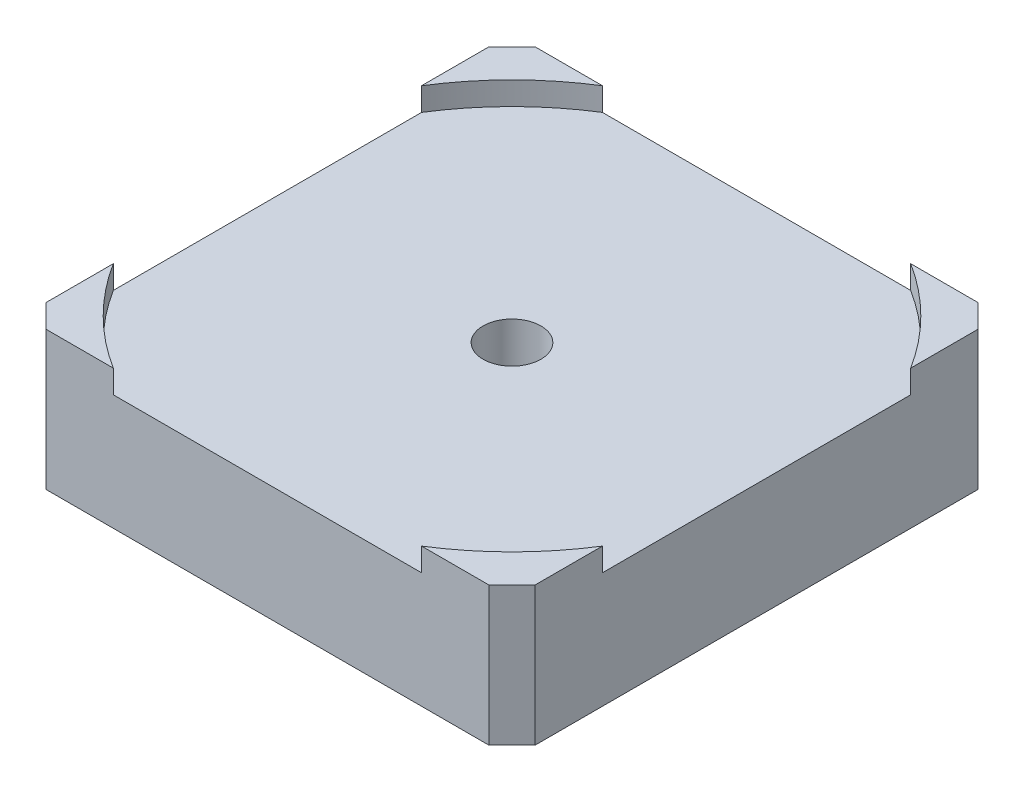
ISO-10303-21;
HEADER;
FILE_DESCRIPTION(('STEP AP214'),'2;1');
FILE_NAME('part.step','',(''),(''),'','','');
FILE_SCHEMA(('AUTOMOTIVE_DESIGN { 1 0 10303 214 1 1 1 1 }'));
ENDSEC;
DATA;
#1=APPLICATION_CONTEXT('core data for automotive mechanical design processes');
#2=APPLICATION_PROTOCOL_DEFINITION('international standard','automotive_design',2000,#1);
#3=PRODUCT_CONTEXT('',#1,'mechanical');
#4=PRODUCT('Part','Part','',(#3));
#5=PRODUCT_RELATED_PRODUCT_CATEGORY('part','',(#4));
#6=PRODUCT_DEFINITION_FORMATION('','',#4);
#7=PRODUCT_DEFINITION_CONTEXT('part definition',#1,'design');
#8=PRODUCT_DEFINITION('design','',#6,#7);
#9=PRODUCT_DEFINITION_SHAPE('','',#8);
#10=(LENGTH_UNIT() NAMED_UNIT(*) SI_UNIT(.MILLI.,.METRE.));
#11=(NAMED_UNIT(*) PLANE_ANGLE_UNIT() SI_UNIT($,.RADIAN.));
#12=(NAMED_UNIT(*) SI_UNIT($,.STERADIAN.) SOLID_ANGLE_UNIT());
#13=UNCERTAINTY_MEASURE_WITH_UNIT(LENGTH_MEASURE(1.E-05),#10,'distance_accuracy_value','');
#14=(GEOMETRIC_REPRESENTATION_CONTEXT(3) GLOBAL_UNCERTAINTY_ASSIGNED_CONTEXT((#13)) GLOBAL_UNIT_ASSIGNED_CONTEXT((#10,
#11,#12)) REPRESENTATION_CONTEXT('',''));
#15=CARTESIAN_POINT('',(0.,0.,0.));
#16=DIRECTION('',(0.,0.,1.));
#17=DIRECTION('',(1.,0.,0.));
#18=AXIS2_PLACEMENT_3D('',#15,#16,#17);
#19=CARTESIAN_POINT('',(0.,12.,0.));
#20=DIRECTION('',(0.,-1.,0.));
#21=DIRECTION('',(0.,0.,-1.));
#22=AXIS2_PLACEMENT_3D('',#19,#20,#21);
#23=PLANE('',#22);
#24=DIRECTION('',(-1.,0.,0.));
#25=VECTOR('',#24,1.);
#26=CARTESIAN_POINT('',(-21.15,12.,-21.15));
#27=LINE('',#26,#25);
#28=CARTESIAN_POINT('',(-13.3295723862396,12.,-21.15));
#29=VERTEX_POINT('',#28);
#30=CARTESIAN_POINT('',(-19.15,12.,-21.15));
#31=VERTEX_POINT('',#30);
#32=EDGE_CURVE('E227',#29,#31,#27,.T.);
#33=ORIENTED_EDGE('',*,*,#32,.T.);
#34=DIRECTION('',(0.707106781186549,0.,-0.707106781186546));
#35=VECTOR('',#34,1.);
#36=CARTESIAN_POINT('',(-21.15,12.,-19.15));
#37=LINE('',#36,#35);
#38=CARTESIAN_POINT('',(-21.15,12.,-19.15));
#39=VERTEX_POINT('',#38);
#40=EDGE_CURVE('E272',#31,#39,#37,.F.);
#41=ORIENTED_EDGE('',*,*,#40,.T.);
#42=DIRECTION('',(0.,0.,1.));
#43=VECTOR('',#42,1.);
#44=CARTESIAN_POINT('',(-21.15,12.,21.15));
#45=LINE('',#44,#43);
#46=CARTESIAN_POINT('',(-21.15,12.,-13.3295723862396));
#47=VERTEX_POINT('',#46);
#48=EDGE_CURVE('E232',#39,#47,#45,.T.);
#49=ORIENTED_EDGE('',*,*,#48,.T.);
#50=CARTESIAN_POINT('',(0.,12.,0.));
#51=DIRECTION('',(0.,1.,0.));
#52=DIRECTION('',(0.,0.,1.));
#53=AXIS2_PLACEMENT_3D('',#50,#51,#52);
#54=CIRCLE('',#53,25.);
#55=EDGE_CURVE('E161',#29,#47,#54,.T.);
#56=ORIENTED_EDGE('',*,*,#55,.F.);
#57=EDGE_LOOP('',(#33,#41,#49,#56));
#58=FACE_BOUND('',#57,.T.);
#59=ADVANCED_FACE('F40',(#58),#23,.F.);
#60=DIRECTION('',(0.,0.,-1.));
#61=VECTOR('',#60,1.);
#62=CARTESIAN_POINT('',(21.15,12.,21.15));
#63=LINE('',#62,#61);
#64=CARTESIAN_POINT('',(21.15,12.,-13.3295723862396));
#65=VERTEX_POINT('',#64);
#66=CARTESIAN_POINT('',(21.15,12.,-19.15));
#67=VERTEX_POINT('',#66);
#68=EDGE_CURVE('E228',#65,#67,#63,.T.);
#69=ORIENTED_EDGE('',*,*,#68,.T.);
#70=DIRECTION('',(0.707106781186546,0.,0.707106781186549));
#71=VECTOR('',#70,1.);
#72=CARTESIAN_POINT('',(19.15,12.,-21.15));
#73=LINE('',#72,#71);
#74=CARTESIAN_POINT('',(19.15,12.,-21.15));
#75=VERTEX_POINT('',#74);
#76=EDGE_CURVE('E265',#67,#75,#73,.F.);
#77=ORIENTED_EDGE('',*,*,#76,.T.);
#78=CARTESIAN_POINT('',(13.3295723862396,12.,-21.15));
#79=VERTEX_POINT('',#78);
#80=EDGE_CURVE('E229',#75,#79,#27,.T.);
#81=ORIENTED_EDGE('',*,*,#80,.T.);
#82=CARTESIAN_POINT('',(0.,12.,0.));
#83=DIRECTION('',(0.,1.,0.));
#84=DIRECTION('',(0.,0.,1.));
#85=AXIS2_PLACEMENT_3D('',#82,#83,#84);
#86=CIRCLE('',#85,25.);
#87=EDGE_CURVE('E177',#65,#79,#86,.T.);
#88=ORIENTED_EDGE('',*,*,#87,.F.);
#89=EDGE_LOOP('',(#69,#77,#81,#88));
#90=FACE_BOUND('',#89,.T.);
#91=ADVANCED_FACE('F319',(#90),#23,.F.);
#92=DIRECTION('',(1.,0.,0.));
#93=VECTOR('',#92,1.);
#94=CARTESIAN_POINT('',(-21.15,12.,21.15));
#95=LINE('',#94,#93);
#96=CARTESIAN_POINT('',(13.3295723862396,12.,21.15));
#97=VERTEX_POINT('',#96);
#98=CARTESIAN_POINT('',(19.15,12.,21.15));
#99=VERTEX_POINT('',#98);
#100=EDGE_CURVE('E234',#97,#99,#95,.T.);
#101=ORIENTED_EDGE('',*,*,#100,.T.);
#102=DIRECTION('',(-0.707106781186549,0.,0.707106781186546));
#103=VECTOR('',#102,1.);
#104=CARTESIAN_POINT('',(21.15,12.,19.15));
#105=LINE('',#104,#103);
#106=CARTESIAN_POINT('',(21.15,12.,19.15));
#107=VERTEX_POINT('',#106);
#108=EDGE_CURVE('E11',#99,#107,#105,.F.);
#109=ORIENTED_EDGE('',*,*,#108,.T.);
#110=CARTESIAN_POINT('',(21.15,12.,13.3295723862396));
#111=VERTEX_POINT('',#110);
#112=EDGE_CURVE('E225',#107,#111,#63,.T.);
#113=ORIENTED_EDGE('',*,*,#112,.T.);
#114=CARTESIAN_POINT('',(0.,12.,0.));
#115=DIRECTION('',(0.,1.,0.));
#116=DIRECTION('',(0.,0.,1.));
#117=AXIS2_PLACEMENT_3D('',#114,#115,#116);
#118=CIRCLE('',#117,25.);
#119=EDGE_CURVE('E203',#97,#111,#118,.T.);
#120=ORIENTED_EDGE('',*,*,#119,.F.);
#121=EDGE_LOOP('',(#101,#109,#113,#120));
#122=FACE_BOUND('',#121,.T.);
#123=ADVANCED_FACE('F296',(#122),#23,.F.);
#124=CARTESIAN_POINT('',(21.15,12.,21.15));
#125=DIRECTION('',(-1.,0.,0.));
#126=DIRECTION('',(0.,0.,1.));
#127=AXIS2_PLACEMENT_3D('',#124,#125,#126);
#128=PLANE('',#127);
#129=DIRECTION('',(0.,0.,-1.));
#130=VECTOR('',#129,1.);
#131=CARTESIAN_POINT('',(21.15,0.,21.15));
#132=LINE('',#131,#130);
#133=CARTESIAN_POINT('',(21.15,0.,19.15));
#134=VERTEX_POINT('',#133);
#135=CARTESIAN_POINT('',(21.15,0.,-19.15));
#136=VERTEX_POINT('',#135);
#137=EDGE_CURVE('E210',#134,#136,#132,.T.);
#138=ORIENTED_EDGE('',*,*,#137,.T.);
#139=DIRECTION('',(0.,1.,0.));
#140=VECTOR('',#139,1.);
#141=CARTESIAN_POINT('',(21.15,12.,-19.15));
#142=LINE('',#141,#140);
#143=EDGE_CURVE('E263',#136,#67,#142,.T.);
#144=ORIENTED_EDGE('',*,*,#143,.T.);
#145=ORIENTED_EDGE('',*,*,#68,.F.);
#146=DIRECTION('',(0.,1.,0.));
#147=VECTOR('',#146,1.);
#148=CARTESIAN_POINT('',(21.15,10.,-13.3295723862396));
#149=LINE('',#148,#147);
#150=CARTESIAN_POINT('',(21.15,10.,-13.3295723862396));
#151=VERTEX_POINT('',#150);
#152=EDGE_CURVE('E214',#151,#65,#149,.T.);
#153=ORIENTED_EDGE('',*,*,#152,.F.);
#154=DIRECTION('',(0.,0.,-1.));
#155=VECTOR('',#154,1.);
#156=CARTESIAN_POINT('',(21.15,10.,-13.3295723862396));
#157=LINE('',#156,#155);
#158=CARTESIAN_POINT('',(21.15,10.,13.3295723862396));
#159=VERTEX_POINT('',#158);
#160=EDGE_CURVE('E192',#159,#151,#157,.T.);
#161=ORIENTED_EDGE('',*,*,#160,.F.);
#162=DIRECTION('',(0.,1.,0.));
#163=VECTOR('',#162,1.);
#164=CARTESIAN_POINT('',(21.15,10.,13.3295723862396));
#165=LINE('',#164,#163);
#166=EDGE_CURVE('E216',#159,#111,#165,.T.);
#167=ORIENTED_EDGE('',*,*,#166,.T.);
#168=ORIENTED_EDGE('',*,*,#112,.F.);
#169=DIRECTION('',(0.,-1.,0.));
#170=VECTOR('',#169,1.);
#171=CARTESIAN_POINT('',(21.15,12.,19.15));
#172=LINE('',#171,#170);
#173=EDGE_CURVE('E260',#107,#134,#172,.T.);
#174=ORIENTED_EDGE('',*,*,#173,.T.);
#175=EDGE_LOOP('',(#138,#144,#145,#153,#161,#167,#168,#174));
#176=FACE_BOUND('',#175,.T.);
#177=ADVANCED_FACE('F291',(#176),#128,.F.);
#178=CARTESIAN_POINT('',(-21.15,12.,-21.15));
#179=DIRECTION('',(0.,0.,1.));
#180=DIRECTION('',(1.,0.,0.));
#181=AXIS2_PLACEMENT_3D('',#178,#179,#180);
#182=PLANE('',#181);
#183=ORIENTED_EDGE('',*,*,#80,.F.);
#184=DIRECTION('',(0.,-1.,0.));
#185=VECTOR('',#184,1.);
#186=CARTESIAN_POINT('',(19.15,12.,-21.15));
#187=LINE('',#186,#185);
#188=CARTESIAN_POINT('',(19.15,0.,-21.15));
#189=VERTEX_POINT('',#188);
#190=EDGE_CURVE('E249',#75,#189,#187,.T.);
#191=ORIENTED_EDGE('',*,*,#190,.T.);
#192=DIRECTION('',(-1.,0.,0.));
#193=VECTOR('',#192,1.);
#194=CARTESIAN_POINT('',(-21.15,0.,-21.15));
#195=LINE('',#194,#193);
#196=CARTESIAN_POINT('',(-19.15,0.,-21.15));
#197=VERTEX_POINT('',#196);
#198=EDGE_CURVE('E240',#189,#197,#195,.T.);
#199=ORIENTED_EDGE('',*,*,#198,.T.);
#200=DIRECTION('',(0.,1.,0.));
#201=VECTOR('',#200,1.);
#202=CARTESIAN_POINT('',(-19.15,12.,-21.15));
#203=LINE('',#202,#201);
#204=EDGE_CURVE('E237',#197,#31,#203,.T.);
#205=ORIENTED_EDGE('',*,*,#204,.T.);
#206=ORIENTED_EDGE('',*,*,#32,.F.);
#207=DIRECTION('',(0.,1.,0.));
#208=VECTOR('',#207,1.);
#209=CARTESIAN_POINT('',(-13.3295723862396,10.,-21.15));
#210=LINE('',#209,#208);
#211=CARTESIAN_POINT('',(-13.3295723862396,10.,-21.15));
#212=VERTEX_POINT('',#211);
#213=EDGE_CURVE('E208',#212,#29,#210,.T.);
#214=ORIENTED_EDGE('',*,*,#213,.F.);
#215=DIRECTION('',(-1.,0.,0.));
#216=VECTOR('',#215,1.);
#217=CARTESIAN_POINT('',(-13.3295723862396,10.,-21.15));
#218=LINE('',#217,#216);
#219=CARTESIAN_POINT('',(13.3295723862396,10.,-21.15));
#220=VERTEX_POINT('',#219);
#221=EDGE_CURVE('E166',#220,#212,#218,.T.);
#222=ORIENTED_EDGE('',*,*,#221,.F.);
#223=DIRECTION('',(0.,1.,0.));
#224=VECTOR('',#223,1.);
#225=CARTESIAN_POINT('',(13.3295723862396,10.,-21.15));
#226=LINE('',#225,#224);
#227=EDGE_CURVE('E211',#220,#79,#226,.T.);
#228=ORIENTED_EDGE('',*,*,#227,.T.);
#229=EDGE_LOOP('',(#183,#191,#199,#205,#206,#214,#222,#228));
#230=FACE_BOUND('',#229,.T.);
#231=ADVANCED_FACE('F340',(#230),#182,.F.);
#232=CARTESIAN_POINT('',(-21.15,12.,21.15));
#233=DIRECTION('',(1.,0.,0.));
#234=DIRECTION('',(0.,0.,-1.));
#235=AXIS2_PLACEMENT_3D('',#232,#233,#234);
#236=PLANE('',#235);
#237=ORIENTED_EDGE('',*,*,#48,.F.);
#238=DIRECTION('',(0.,-1.,0.));
#239=VECTOR('',#238,1.);
#240=CARTESIAN_POINT('',(-21.15,12.,-19.15));
#241=LINE('',#240,#239);
#242=CARTESIAN_POINT('',(-21.15,0.,-19.15));
#243=VERTEX_POINT('',#242);
#244=EDGE_CURVE('E269',#39,#243,#241,.T.);
#245=ORIENTED_EDGE('',*,*,#244,.T.);
#246=DIRECTION('',(0.,0.,1.));
#247=VECTOR('',#246,1.);
#248=CARTESIAN_POINT('',(-21.15,0.,21.15));
#249=LINE('',#248,#247);
#250=CARTESIAN_POINT('',(-21.15,0.,19.15));
#251=VERTEX_POINT('',#250);
#252=EDGE_CURVE('E243',#243,#251,#249,.T.);
#253=ORIENTED_EDGE('',*,*,#252,.T.);
#254=DIRECTION('',(0.,1.,0.));
#255=VECTOR('',#254,1.);
#256=CARTESIAN_POINT('',(-21.15,12.,19.15));
#257=LINE('',#256,#255);
#258=CARTESIAN_POINT('',(-21.15,12.,19.15));
#259=VERTEX_POINT('',#258);
#260=EDGE_CURVE('E267',#251,#259,#257,.T.);
#261=ORIENTED_EDGE('',*,*,#260,.T.);
#262=CARTESIAN_POINT('',(-21.15,12.,13.3295723862396));
#263=VERTEX_POINT('',#262);
#264=EDGE_CURVE('E231',#263,#259,#45,.T.);
#265=ORIENTED_EDGE('',*,*,#264,.F.);
#266=DIRECTION('',(0.,1.,0.));
#267=VECTOR('',#266,1.);
#268=CARTESIAN_POINT('',(-21.15,10.,13.3295723862396));
#269=LINE('',#268,#267);
#270=CARTESIAN_POINT('',(-21.15,10.,13.3295723862396));
#271=VERTEX_POINT('',#270);
#272=EDGE_CURVE('E165',#271,#263,#269,.T.);
#273=ORIENTED_EDGE('',*,*,#272,.F.);
#274=DIRECTION('',(0.,0.,1.));
#275=VECTOR('',#274,1.);
#276=CARTESIAN_POINT('',(-21.15,10.,-13.3295723862396));
#277=LINE('',#276,#275);
#278=CARTESIAN_POINT('',(-21.15,10.,-13.3295723862396));
#279=VERTEX_POINT('',#278);
#280=EDGE_CURVE('E172',#279,#271,#277,.T.);
#281=ORIENTED_EDGE('',*,*,#280,.F.);
#282=DIRECTION('',(0.,1.,0.));
#283=VECTOR('',#282,1.);
#284=CARTESIAN_POINT('',(-21.15,10.,-13.3295723862396));
#285=LINE('',#284,#283);
#286=EDGE_CURVE('E155',#279,#47,#285,.T.);
#287=ORIENTED_EDGE('',*,*,#286,.T.);
#288=EDGE_LOOP('',(#237,#245,#253,#261,#265,#273,#281,#287));
#289=FACE_BOUND('',#288,.T.);
#290=ADVANCED_FACE('F179',(#289),#236,.F.);
#291=CARTESIAN_POINT('',(-21.15,12.,21.15));
#292=DIRECTION('',(0.,0.,-1.));
#293=DIRECTION('',(-1.,0.,0.));
#294=AXIS2_PLACEMENT_3D('',#291,#292,#293);
#295=PLANE('',#294);
#296=CARTESIAN_POINT('',(-19.15,12.,21.15));
#297=VERTEX_POINT('',#296);
#298=CARTESIAN_POINT('',(-13.3295723862396,12.,21.15));
#299=VERTEX_POINT('',#298);
#300=EDGE_CURVE('E235',#297,#299,#95,.T.);
#301=ORIENTED_EDGE('',*,*,#300,.F.);
#302=DIRECTION('',(0.,-1.,0.));
#303=VECTOR('',#302,1.);
#304=CARTESIAN_POINT('',(-19.15,12.,21.15));
#305=LINE('',#304,#303);
#306=CARTESIAN_POINT('',(-19.15,0.,21.15));
#307=VERTEX_POINT('',#306);
#308=EDGE_CURVE('E275',#297,#307,#305,.T.);
#309=ORIENTED_EDGE('',*,*,#308,.T.);
#310=DIRECTION('',(1.,0.,0.));
#311=VECTOR('',#310,1.);
#312=CARTESIAN_POINT('',(-21.15,0.,21.15));
#313=LINE('',#312,#311);
#314=CARTESIAN_POINT('',(19.15,0.,21.15));
#315=VERTEX_POINT('',#314);
#316=EDGE_CURVE('E246',#307,#315,#313,.T.);
#317=ORIENTED_EDGE('',*,*,#316,.T.);
#318=DIRECTION('',(0.,1.,0.));
#319=VECTOR('',#318,1.);
#320=CARTESIAN_POINT('',(19.15,12.,21.15));
#321=LINE('',#320,#319);
#322=EDGE_CURVE('E63',#315,#99,#321,.T.);
#323=ORIENTED_EDGE('',*,*,#322,.T.);
#324=ORIENTED_EDGE('',*,*,#100,.F.);
#325=DIRECTION('',(0.,1.,0.));
#326=VECTOR('',#325,1.);
#327=CARTESIAN_POINT('',(13.3295723862396,10.,21.15));
#328=LINE('',#327,#326);
#329=CARTESIAN_POINT('',(13.3295723862396,10.,21.15));
#330=VERTEX_POINT('',#329);
#331=EDGE_CURVE('E219',#330,#97,#328,.T.);
#332=ORIENTED_EDGE('',*,*,#331,.F.);
#333=DIRECTION('',(1.,0.,0.));
#334=VECTOR('',#333,1.);
#335=CARTESIAN_POINT('',(-13.3295723862396,10.,21.15));
#336=LINE('',#335,#334);
#337=CARTESIAN_POINT('',(-13.3295723862396,10.,21.15));
#338=VERTEX_POINT('',#337);
#339=EDGE_CURVE('E183',#338,#330,#336,.T.);
#340=ORIENTED_EDGE('',*,*,#339,.F.);
#341=DIRECTION('',(0.,1.,0.));
#342=VECTOR('',#341,1.);
#343=CARTESIAN_POINT('',(-13.3295723862396,10.,21.15));
#344=LINE('',#343,#342);
#345=EDGE_CURVE('E221',#338,#299,#344,.T.);
#346=ORIENTED_EDGE('',*,*,#345,.T.);
#347=EDGE_LOOP('',(#301,#309,#317,#323,#324,#332,#340,#346));
#348=FACE_BOUND('',#347,.T.);
#349=ADVANCED_FACE('F279',(#348),#295,.F.);
#350=ORIENTED_EDGE('',*,*,#264,.T.);
#351=DIRECTION('',(-0.707106781186546,0.,-0.707106781186549));
#352=VECTOR('',#351,1.);
#353=CARTESIAN_POINT('',(-19.15,12.,21.15));
#354=LINE('',#353,#352);
#355=EDGE_CURVE('E49',#259,#297,#354,.F.);
#356=ORIENTED_EDGE('',*,*,#355,.T.);
#357=ORIENTED_EDGE('',*,*,#300,.T.);
#358=CARTESIAN_POINT('',(0.,12.,0.));
#359=DIRECTION('',(0.,1.,0.));
#360=DIRECTION('',(0.,0.,1.));
#361=AXIS2_PLACEMENT_3D('',#358,#359,#360);
#362=CIRCLE('',#361,25.);
#363=EDGE_CURVE('E199',#263,#299,#362,.T.);
#364=ORIENTED_EDGE('',*,*,#363,.F.);
#365=EDGE_LOOP('',(#350,#356,#357,#364));
#366=FACE_BOUND('',#365,.T.);
#367=ADVANCED_FACE('F304',(#366),#23,.F.);
#368=CARTESIAN_POINT('',(0.,0.,0.));
#369=DIRECTION('',(0.,-1.,0.));
#370=DIRECTION('',(0.,0.,-1.));
#371=AXIS2_PLACEMENT_3D('',#368,#369,#370);
#372=PLANE('',#371);
#373=CARTESIAN_POINT('',(0.,0.,0.));
#374=DIRECTION('',(0.,1.,0.));
#375=DIRECTION('',(0.,0.,1.));
#376=AXIS2_PLACEMENT_3D('',#373,#374,#375);
#377=CIRCLE('',#376,2.5);
#378=CARTESIAN_POINT('',(0.,0.,2.5));
#379=VERTEX_POINT('',#378);
#380=EDGE_CURVE('E200',#379,#379,#377,.T.);
#381=ORIENTED_EDGE('',*,*,#380,.T.);
#382=EDGE_LOOP('',(#381));
#383=FACE_BOUND('',#382,.T.);
#384=ORIENTED_EDGE('',*,*,#198,.F.);
#385=DIRECTION('',(-0.707106781186546,0.,-0.707106781186549));
#386=VECTOR('',#385,1.);
#387=CARTESIAN_POINT('',(20.15,0.,-20.15));
#388=LINE('',#387,#386);
#389=EDGE_CURVE('E258',#189,#136,#388,.F.);
#390=ORIENTED_EDGE('',*,*,#389,.T.);
#391=ORIENTED_EDGE('',*,*,#137,.F.);
#392=DIRECTION('',(0.707106781186549,0.,-0.707106781186546));
#393=VECTOR('',#392,1.);
#394=CARTESIAN_POINT('',(20.15,0.,20.15));
#395=LINE('',#394,#393);
#396=EDGE_CURVE('E252',#134,#315,#395,.F.);
#397=ORIENTED_EDGE('',*,*,#396,.T.);
#398=ORIENTED_EDGE('',*,*,#316,.F.);
#399=DIRECTION('',(0.707106781186546,0.,0.707106781186549));
#400=VECTOR('',#399,1.);
#401=CARTESIAN_POINT('',(-20.15,0.,20.15));
#402=LINE('',#401,#400);
#403=EDGE_CURVE('E254',#307,#251,#402,.F.);
#404=ORIENTED_EDGE('',*,*,#403,.T.);
#405=ORIENTED_EDGE('',*,*,#252,.F.);
#406=DIRECTION('',(-0.707106781186549,0.,0.707106781186546));
#407=VECTOR('',#406,1.);
#408=CARTESIAN_POINT('',(-20.15,0.,-20.15));
#409=LINE('',#408,#407);
#410=EDGE_CURVE('E256',#243,#197,#409,.F.);
#411=ORIENTED_EDGE('',*,*,#410,.T.);
#412=EDGE_LOOP('',(#384,#390,#391,#397,#398,#404,#405,#411));
#413=FACE_BOUND('',#412,.T.);
#414=ADVANCED_FACE('F283',(#383,#413),#372,.T.);
#415=CARTESIAN_POINT('',(0.,10.,0.));
#416=DIRECTION('',(0.,1.,0.));
#417=DIRECTION('',(0.,0.,1.));
#418=AXIS2_PLACEMENT_3D('',#415,#416,#417);
#419=CYLINDRICAL_SURFACE('',#418,25.);
#420=ORIENTED_EDGE('',*,*,#55,.T.);
#421=ORIENTED_EDGE('',*,*,#286,.F.);
#422=CARTESIAN_POINT('',(0.,10.,0.));
#423=DIRECTION('',(0.,1.,0.));
#424=DIRECTION('',(0.,0.,1.));
#425=AXIS2_PLACEMENT_3D('',#422,#423,#424);
#426=CIRCLE('',#425,25.);
#427=EDGE_CURVE('E158',#212,#279,#426,.T.);
#428=ORIENTED_EDGE('',*,*,#427,.F.);
#429=ORIENTED_EDGE('',*,*,#213,.T.);
#430=EDGE_LOOP('',(#420,#421,#428,#429));
#431=FACE_BOUND('',#430,.T.);
#432=ADVANCED_FACE('F157',(#431),#419,.F.);
#433=CARTESIAN_POINT('',(0.,10.,0.));
#434=DIRECTION('',(0.,1.,0.));
#435=DIRECTION('',(0.,0.,1.));
#436=AXIS2_PLACEMENT_3D('',#433,#434,#435);
#437=CYLINDRICAL_SURFACE('',#436,25.);
#438=ORIENTED_EDGE('',*,*,#87,.T.);
#439=ORIENTED_EDGE('',*,*,#227,.F.);
#440=CARTESIAN_POINT('',(0.,10.,0.));
#441=DIRECTION('',(0.,1.,0.));
#442=DIRECTION('',(0.,0.,1.));
#443=AXIS2_PLACEMENT_3D('',#440,#441,#442);
#444=CIRCLE('',#443,25.);
#445=EDGE_CURVE('E195',#151,#220,#444,.T.);
#446=ORIENTED_EDGE('',*,*,#445,.F.);
#447=ORIENTED_EDGE('',*,*,#152,.T.);
#448=EDGE_LOOP('',(#438,#439,#446,#447));
#449=FACE_BOUND('',#448,.T.);
#450=ADVANCED_FACE('F373',(#449),#437,.F.);
#451=CARTESIAN_POINT('',(0.,10.,0.));
#452=DIRECTION('',(0.,1.,0.));
#453=DIRECTION('',(0.,0.,1.));
#454=AXIS2_PLACEMENT_3D('',#451,#452,#453);
#455=CYLINDRICAL_SURFACE('',#454,25.);
#456=ORIENTED_EDGE('',*,*,#119,.T.);
#457=ORIENTED_EDGE('',*,*,#166,.F.);
#458=CARTESIAN_POINT('',(0.,10.,0.));
#459=DIRECTION('',(0.,1.,0.));
#460=DIRECTION('',(0.,0.,1.));
#461=AXIS2_PLACEMENT_3D('',#458,#459,#460);
#462=CIRCLE('',#461,25.);
#463=EDGE_CURVE('E189',#330,#159,#462,.T.);
#464=ORIENTED_EDGE('',*,*,#463,.F.);
#465=ORIENTED_EDGE('',*,*,#331,.T.);
#466=EDGE_LOOP('',(#456,#457,#464,#465));
#467=FACE_BOUND('',#466,.T.);
#468=ADVANCED_FACE('F298',(#467),#455,.F.);
#469=CARTESIAN_POINT('',(0.,10.,0.));
#470=DIRECTION('',(0.,1.,0.));
#471=DIRECTION('',(0.,0.,1.));
#472=AXIS2_PLACEMENT_3D('',#469,#470,#471);
#473=CYLINDRICAL_SURFACE('',#472,25.);
#474=ORIENTED_EDGE('',*,*,#363,.T.);
#475=ORIENTED_EDGE('',*,*,#345,.F.);
#476=CARTESIAN_POINT('',(0.,10.,0.));
#477=DIRECTION('',(0.,1.,0.));
#478=DIRECTION('',(0.,0.,1.));
#479=AXIS2_PLACEMENT_3D('',#476,#477,#478);
#480=CIRCLE('',#479,25.);
#481=EDGE_CURVE('E181',#271,#338,#480,.T.);
#482=ORIENTED_EDGE('',*,*,#481,.F.);
#483=ORIENTED_EDGE('',*,*,#272,.T.);
#484=EDGE_LOOP('',(#474,#475,#482,#483));
#485=FACE_BOUND('',#484,.T.);
#486=ADVANCED_FACE('F302',(#485),#473,.F.);
#487=CARTESIAN_POINT('',(0.,10.,0.));
#488=DIRECTION('',(0.,1.,0.));
#489=DIRECTION('',(0.,0.,1.));
#490=AXIS2_PLACEMENT_3D('',#487,#488,#489);
#491=PLANE('',#490);
#492=CARTESIAN_POINT('',(0.,10.,0.));
#493=DIRECTION('',(0.,1.,0.));
#494=DIRECTION('',(0.,0.,1.));
#495=AXIS2_PLACEMENT_3D('',#492,#493,#494);
#496=CIRCLE('',#495,2.5);
#497=CARTESIAN_POINT('',(0.,10.,2.5));
#498=VERTEX_POINT('',#497);
#499=EDGE_CURVE('E493',#498,#498,#496,.T.);
#500=ORIENTED_EDGE('',*,*,#499,.F.);
#501=EDGE_LOOP('',(#500));
#502=FACE_BOUND('',#501,.T.);
#503=ORIENTED_EDGE('',*,*,#427,.T.);
#504=ORIENTED_EDGE('',*,*,#280,.T.);
#505=ORIENTED_EDGE('',*,*,#481,.T.);
#506=ORIENTED_EDGE('',*,*,#339,.T.);
#507=ORIENTED_EDGE('',*,*,#463,.T.);
#508=ORIENTED_EDGE('',*,*,#160,.T.);
#509=ORIENTED_EDGE('',*,*,#445,.T.);
#510=ORIENTED_EDGE('',*,*,#221,.T.);
#511=EDGE_LOOP('',(#503,#504,#505,#506,#507,#508,#509,#510));
#512=FACE_BOUND('',#511,.T.);
#513=ADVANCED_FACE('F170',(#502,#512),#491,.T.);
#514=CARTESIAN_POINT('',(19.15,12.,-21.15));
#515=DIRECTION('',(-0.707106781186549,0.,0.707106781186546));
#516=DIRECTION('',(0.,-1.,0.));
#517=AXIS2_PLACEMENT_3D('',#514,#515,#516);
#518=PLANE('',#517);
#519=ORIENTED_EDGE('',*,*,#76,.F.);
#520=ORIENTED_EDGE('',*,*,#143,.F.);
#521=ORIENTED_EDGE('',*,*,#389,.F.);
#522=ORIENTED_EDGE('',*,*,#190,.F.);
#523=EDGE_LOOP('',(#519,#520,#521,#522));
#524=FACE_BOUND('',#523,.T.);
#525=ADVANCED_FACE('F314',(#524),#518,.F.);
#526=CARTESIAN_POINT('',(-21.15,12.,-19.15));
#527=DIRECTION('',(0.707106781186546,0.,0.707106781186549));
#528=DIRECTION('',(0.,-1.,0.));
#529=AXIS2_PLACEMENT_3D('',#526,#527,#528);
#530=PLANE('',#529);
#531=ORIENTED_EDGE('',*,*,#40,.F.);
#532=ORIENTED_EDGE('',*,*,#204,.F.);
#533=ORIENTED_EDGE('',*,*,#410,.F.);
#534=ORIENTED_EDGE('',*,*,#244,.F.);
#535=EDGE_LOOP('',(#531,#532,#533,#534));
#536=FACE_BOUND('',#535,.T.);
#537=ADVANCED_FACE('F308',(#536),#530,.F.);
#538=CARTESIAN_POINT('',(-19.15,12.,21.15));
#539=DIRECTION('',(0.707106781186549,0.,-0.707106781186546));
#540=DIRECTION('',(0.,-1.,0.));
#541=AXIS2_PLACEMENT_3D('',#538,#539,#540);
#542=PLANE('',#541);
#543=ORIENTED_EDGE('',*,*,#355,.F.);
#544=ORIENTED_EDGE('',*,*,#260,.F.);
#545=ORIENTED_EDGE('',*,*,#403,.F.);
#546=ORIENTED_EDGE('',*,*,#308,.F.);
#547=EDGE_LOOP('',(#543,#544,#545,#546));
#548=FACE_BOUND('',#547,.T.);
#549=ADVANCED_FACE('F306',(#548),#542,.F.);
#550=CARTESIAN_POINT('',(21.15,12.,19.15));
#551=DIRECTION('',(-0.707106781186546,0.,-0.707106781186549));
#552=DIRECTION('',(0.,-1.,0.));
#553=AXIS2_PLACEMENT_3D('',#550,#551,#552);
#554=PLANE('',#553);
#555=ORIENTED_EDGE('',*,*,#108,.F.);
#556=ORIENTED_EDGE('',*,*,#322,.F.);
#557=ORIENTED_EDGE('',*,*,#396,.F.);
#558=ORIENTED_EDGE('',*,*,#173,.F.);
#559=EDGE_LOOP('',(#555,#556,#557,#558));
#560=FACE_BOUND('',#559,.T.);
#561=ADVANCED_FACE('F43',(#560),#554,.F.);
#562=CARTESIAN_POINT('',(0.,0.,0.));
#563=DIRECTION('',(0.,1.,0.));
#564=DIRECTION('',(0.,0.,1.));
#565=AXIS2_PLACEMENT_3D('',#562,#563,#564);
#566=CYLINDRICAL_SURFACE('',#565,2.5);
#567=ORIENTED_EDGE('',*,*,#380,.F.);
#568=EDGE_LOOP('',(#567));
#569=FACE_BOUND('',#568,.T.);
#570=ORIENTED_EDGE('',*,*,#499,.T.);
#571=EDGE_LOOP('',(#570));
#572=FACE_BOUND('',#571,.T.);
#573=ADVANCED_FACE('F313',(#569,#572),#566,.F.);
#574=CLOSED_SHELL('',(#59,#91,#123,#177,#231,#290,#349,#367,#414,#432,#450,#468,#486,#513,#525,
#537,#549,#561,#573));
#575=MANIFOLD_SOLID_BREP('B2',#574);
#576=ADVANCED_BREP_SHAPE_REPRESENTATION('',(#18,#575),#14);
#577=SHAPE_DEFINITION_REPRESENTATION(#9,#576);
ENDSEC;
END-ISO-10303-21;
